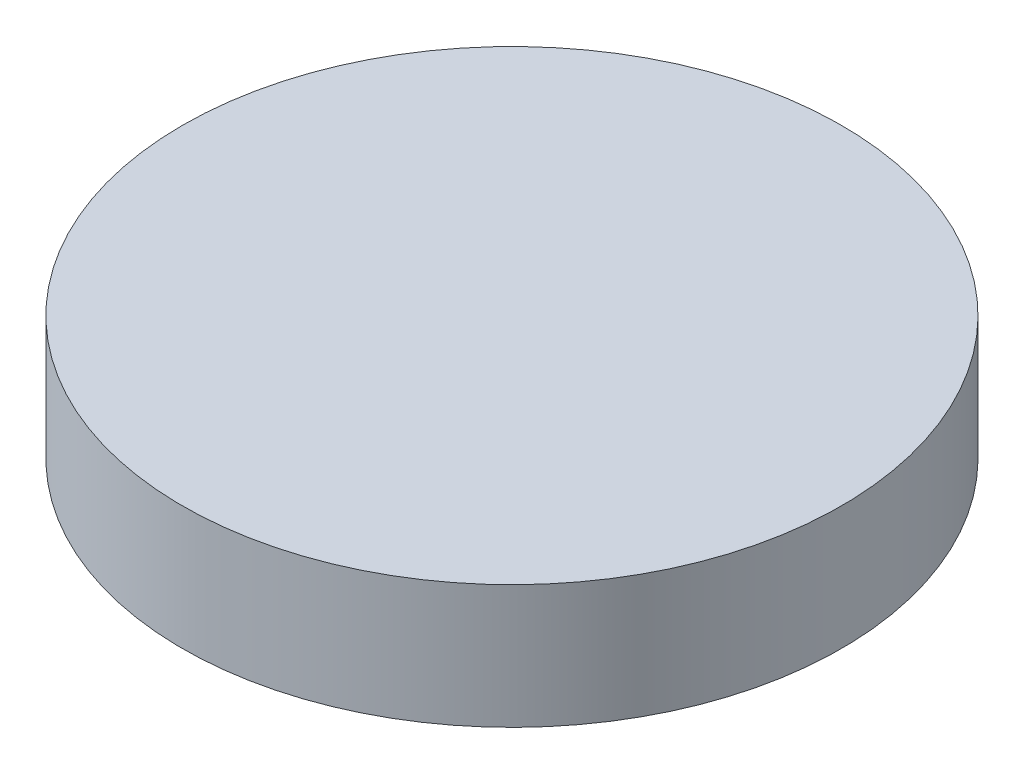
ISO-10303-21;
HEADER;
FILE_DESCRIPTION(('STEP AP214'),'2;1');
FILE_NAME('part.step','',(''),(''),'','','');
FILE_SCHEMA(('AUTOMOTIVE_DESIGN { 1 0 10303 214 1 1 1 1 }'));
ENDSEC;
DATA;
#1=APPLICATION_CONTEXT('core data for automotive mechanical design processes');
#2=APPLICATION_PROTOCOL_DEFINITION('international standard','automotive_design',2000,#1);
#3=PRODUCT_CONTEXT('',#1,'mechanical');
#4=PRODUCT('Part','Part','',(#3));
#5=PRODUCT_RELATED_PRODUCT_CATEGORY('part','',(#4));
#6=PRODUCT_DEFINITION_FORMATION('','',#4);
#7=PRODUCT_DEFINITION_CONTEXT('part definition',#1,'design');
#8=PRODUCT_DEFINITION('design','',#6,#7);
#9=PRODUCT_DEFINITION_SHAPE('','',#8);
#10=(LENGTH_UNIT() NAMED_UNIT(*) SI_UNIT(.MILLI.,.METRE.));
#11=(NAMED_UNIT(*) PLANE_ANGLE_UNIT() SI_UNIT($,.RADIAN.));
#12=(NAMED_UNIT(*) SI_UNIT($,.STERADIAN.) SOLID_ANGLE_UNIT());
#13=UNCERTAINTY_MEASURE_WITH_UNIT(LENGTH_MEASURE(1.E-05),#10,'distance_accuracy_value','');
#14=(GEOMETRIC_REPRESENTATION_CONTEXT(3) GLOBAL_UNCERTAINTY_ASSIGNED_CONTEXT((#13)) GLOBAL_UNIT_ASSIGNED_CONTEXT((#10,
#11,#12)) REPRESENTATION_CONTEXT('',''));
#15=CARTESIAN_POINT('',(0.,0.,0.));
#16=DIRECTION('',(0.,0.,1.));
#17=DIRECTION('',(1.,0.,0.));
#18=AXIS2_PLACEMENT_3D('',#15,#16,#17);
#19=CARTESIAN_POINT('',(0.,0.,0.));
#20=DIRECTION('',(0.,-1.,0.));
#21=DIRECTION('',(1.,0.,0.));
#22=AXIS2_PLACEMENT_3D('',#19,#20,#21);
#23=PLANE('',#22);
#24=CARTESIAN_POINT('',(0.,0.,0.));
#25=DIRECTION('',(0.,1.,0.));
#26=DIRECTION('',(-1.,0.,0.));
#27=AXIS2_PLACEMENT_3D('',#24,#25,#26);
#28=CIRCLE('',#27,12.7);
#29=CARTESIAN_POINT('',(-12.7,0.,0.));
#30=VERTEX_POINT('',#29);
#31=EDGE_CURVE('E10',#30,#30,#28,.T.);
#32=ORIENTED_EDGE('',*,*,#31,.F.);
#33=EDGE_LOOP('',(#32));
#34=FACE_BOUND('',#33,.T.);
#35=ADVANCED_FACE('F37',(#34),#23,.T.);
#36=CARTESIAN_POINT('',(0.,4.7625,0.));
#37=DIRECTION('',(0.,1.,0.));
#38=DIRECTION('',(-1.,0.,0.));
#39=AXIS2_PLACEMENT_3D('',#36,#37,#38);
#40=CYLINDRICAL_SURFACE('',#39,12.7);
#41=ORIENTED_EDGE('',*,*,#31,.T.);
#42=EDGE_LOOP('',(#41));
#43=FACE_BOUND('',#42,.T.);
#44=CARTESIAN_POINT('',(0.,4.7625,0.));
#45=DIRECTION('',(0.,1.,0.));
#46=DIRECTION('',(-1.,0.,0.));
#47=AXIS2_PLACEMENT_3D('',#44,#45,#46);
#48=CIRCLE('',#47,12.7);
#49=CARTESIAN_POINT('',(-12.7,4.7625,0.));
#50=VERTEX_POINT('',#49);
#51=EDGE_CURVE('E43',#50,#50,#48,.T.);
#52=ORIENTED_EDGE('',*,*,#51,.F.);
#53=EDGE_LOOP('',(#52));
#54=FACE_BOUND('',#53,.T.);
#55=ADVANCED_FACE('F51',(#43,#54),#40,.T.);
#56=CARTESIAN_POINT('',(-12.7,4.7625,0.));
#57=DIRECTION('',(0.,1.,0.));
#58=DIRECTION('',(-1.,0.,0.));
#59=AXIS2_PLACEMENT_3D('',#56,#57,#58);
#60=PLANE('',#59);
#61=ORIENTED_EDGE('',*,*,#51,.T.);
#62=EDGE_LOOP('',(#61));
#63=FACE_BOUND('',#62,.T.);
#64=ADVANCED_FACE('F49',(#63),#60,.T.);
#65=CLOSED_SHELL('',(#35,#55,#64));
#66=MANIFOLD_SOLID_BREP('B2',#65);
#67=ADVANCED_BREP_SHAPE_REPRESENTATION('',(#18,#66),#14);
#68=SHAPE_DEFINITION_REPRESENTATION(#9,#67);
ENDSEC;
END-ISO-10303-21;
